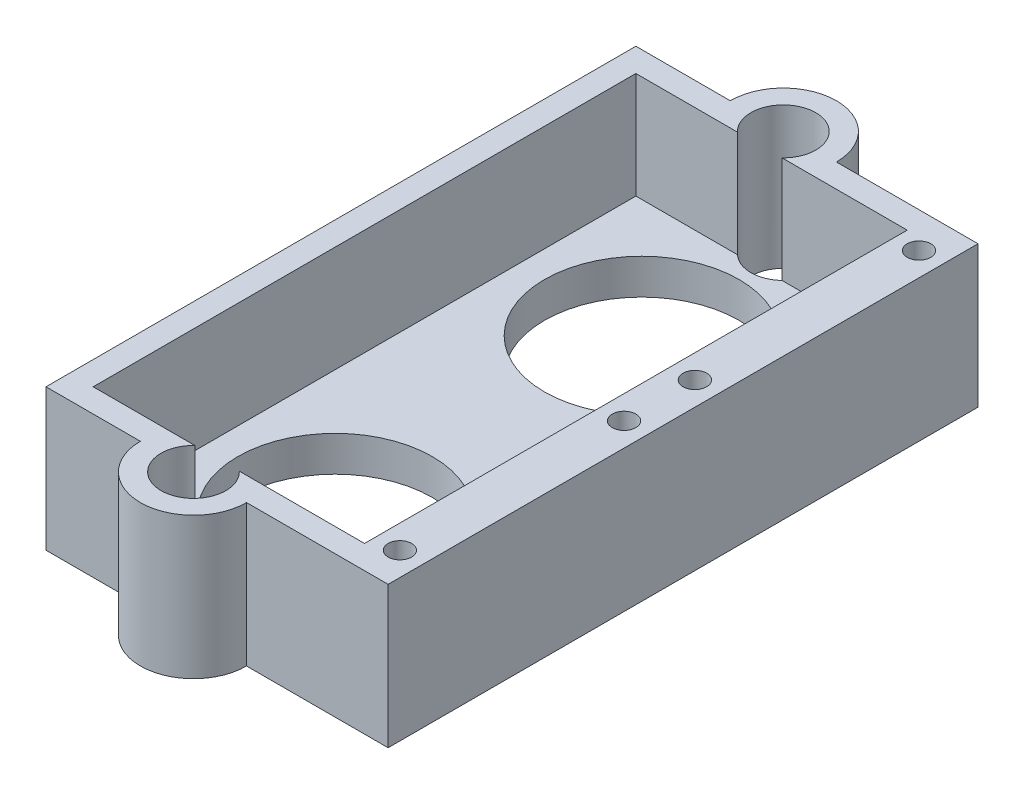
ISO-10303-21;
HEADER;
FILE_DESCRIPTION(('STEP AP214'),'2;1');
FILE_NAME('part.step','',(''),(''),'','','');
FILE_SCHEMA(('AUTOMOTIVE_DESIGN { 1 0 10303 214 1 1 1 1 }'));
ENDSEC;
DATA;
#1=APPLICATION_CONTEXT('core data for automotive mechanical design processes');
#2=APPLICATION_PROTOCOL_DEFINITION('international standard','automotive_design',2000,#1);
#3=PRODUCT_CONTEXT('',#1,'mechanical');
#4=PRODUCT('Part','Part','',(#3));
#5=PRODUCT_RELATED_PRODUCT_CATEGORY('part','',(#4));
#6=PRODUCT_DEFINITION_FORMATION('','',#4);
#7=PRODUCT_DEFINITION_CONTEXT('part definition',#1,'design');
#8=PRODUCT_DEFINITION('design','',#6,#7);
#9=PRODUCT_DEFINITION_SHAPE('','',#8);
#10=(LENGTH_UNIT() NAMED_UNIT(*) SI_UNIT(.MILLI.,.METRE.));
#11=(NAMED_UNIT(*) PLANE_ANGLE_UNIT() SI_UNIT($,.RADIAN.));
#12=(NAMED_UNIT(*) SI_UNIT($,.STERADIAN.) SOLID_ANGLE_UNIT());
#13=UNCERTAINTY_MEASURE_WITH_UNIT(LENGTH_MEASURE(1.E-05),#10,'distance_accuracy_value','');
#14=(GEOMETRIC_REPRESENTATION_CONTEXT(3) GLOBAL_UNCERTAINTY_ASSIGNED_CONTEXT((#13)) GLOBAL_UNIT_ASSIGNED_CONTEXT((#10,
#11,#12)) REPRESENTATION_CONTEXT('',''));
#15=CARTESIAN_POINT('',(0.,0.,0.));
#16=DIRECTION('',(0.,0.,1.));
#17=DIRECTION('',(1.,0.,0.));
#18=AXIS2_PLACEMENT_3D('',#15,#16,#17);
#19=CARTESIAN_POINT('',(0.,-8.25,34.));
#20=DIRECTION('',(0.,0.,-1.));
#21=DIRECTION('',(-1.,0.,0.));
#22=AXIS2_PLACEMENT_3D('',#19,#20,#21);
#23=PLANE('',#22);
#24=DIRECTION('',(-1.,0.,0.));
#25=VECTOR('',#24,1.);
#26=CARTESIAN_POINT('',(0.,3.75,34.));
#27=LINE('',#26,#25);
#28=CARTESIAN_POINT('',(-34.25,3.75,34.));
#29=VERTEX_POINT('',#28);
#30=CARTESIAN_POINT('',(-46.25,3.75,34.));
#31=VERTEX_POINT('',#30);
#32=EDGE_CURVE('E173',#29,#31,#27,.T.);
#33=ORIENTED_EDGE('',*,*,#32,.T.);
#34=DIRECTION('',(0.,-1.,0.));
#35=VECTOR('',#34,1.);
#36=CARTESIAN_POINT('',(-46.25,14.0953004301386,34.));
#37=LINE('',#36,#35);
#38=CARTESIAN_POINT('',(-46.25,-8.25,34.));
#39=VERTEX_POINT('',#38);
#40=EDGE_CURVE('E313',#31,#39,#37,.T.);
#41=ORIENTED_EDGE('',*,*,#40,.T.);
#42=DIRECTION('',(-1.,0.,0.));
#43=VECTOR('',#42,1.);
#44=CARTESIAN_POINT('',(0.,-8.25,34.));
#45=LINE('',#44,#43);
#46=CARTESIAN_POINT('',(-34.25,-8.25,34.));
#47=VERTEX_POINT('',#46);
#48=EDGE_CURVE('E206',#47,#39,#45,.T.);
#49=ORIENTED_EDGE('',*,*,#48,.F.);
#50=DIRECTION('',(0.,-1.,0.));
#51=VECTOR('',#50,1.);
#52=CARTESIAN_POINT('',(-34.25,53.9097448159378,34.));
#53=LINE('',#52,#51);
#54=EDGE_CURVE('E276',#29,#47,#53,.T.);
#55=ORIENTED_EDGE('',*,*,#54,.F.);
#56=EDGE_LOOP('',(#33,#41,#49,#55));
#57=FACE_BOUND('',#56,.T.);
#58=ADVANCED_FACE('F35',(#57),#23,.F.);
#59=CARTESIAN_POINT('',(0.,3.75,32.));
#60=DIRECTION('',(0.,0.,1.));
#61=DIRECTION('',(1.,0.,0.));
#62=AXIS2_PLACEMENT_3D('',#59,#60,#61);
#63=PLANE('',#62);
#64=DIRECTION('',(-1.,0.,0.));
#65=VECTOR('',#64,1.);
#66=CARTESIAN_POINT('',(0.,3.75,32.));
#67=LINE('',#66,#65);
#68=CARTESIAN_POINT('',(-52.6374586088177,3.75,32.));
#69=VERTEX_POINT('',#68);
#70=CARTESIAN_POINT('',(-61.25,3.75,32.));
#71=VERTEX_POINT('',#70);
#72=EDGE_CURVE('E171',#69,#71,#67,.T.);
#73=ORIENTED_EDGE('',*,*,#72,.F.);
#74=DIRECTION('',(0.,1.,0.));
#75=VECTOR('',#74,1.);
#76=CARTESIAN_POINT('',(-52.6374586088177,-14.25,32.));
#77=LINE('',#76,#75);
#78=CARTESIAN_POINT('',(-52.6374586088177,-5.25,32.));
#79=VERTEX_POINT('',#78);
#80=EDGE_CURVE('E50',#69,#79,#77,.F.);
#81=ORIENTED_EDGE('',*,*,#80,.T.);
#82=DIRECTION('',(-1.,0.,0.));
#83=VECTOR('',#82,1.);
#84=CARTESIAN_POINT('',(0.,-5.25,32.));
#85=LINE('',#84,#83);
#86=CARTESIAN_POINT('',(-61.25,-5.25,32.));
#87=VERTEX_POINT('',#86);
#88=EDGE_CURVE('E238',#79,#87,#85,.T.);
#89=ORIENTED_EDGE('',*,*,#88,.T.);
#90=DIRECTION('',(0.,-1.,0.));
#91=VECTOR('',#90,1.);
#92=CARTESIAN_POINT('',(-61.25,3.75,32.));
#93=LINE('',#92,#91);
#94=EDGE_CURVE('E189',#71,#87,#93,.T.);
#95=ORIENTED_EDGE('',*,*,#94,.F.);
#96=EDGE_LOOP('',(#73,#81,#89,#95));
#97=FACE_BOUND('',#96,.T.);
#98=ADVANCED_FACE('F393',(#97),#63,.F.);
#99=CARTESIAN_POINT('',(0.,-8.25,-16.));
#100=DIRECTION('',(0.,0.,-1.));
#101=DIRECTION('',(-1.,0.,0.));
#102=AXIS2_PLACEMENT_3D('',#99,#100,#101);
#103=PLANE('',#102);
#104=DIRECTION('',(0.,-1.,0.));
#105=VECTOR('',#104,1.);
#106=CARTESIAN_POINT('',(-46.25,14.0953004301386,-16.));
#107=LINE('',#106,#105);
#108=CARTESIAN_POINT('',(-46.25,3.75,-16.));
#109=VERTEX_POINT('',#108);
#110=CARTESIAN_POINT('',(-46.25,-8.25,-16.));
#111=VERTEX_POINT('',#110);
#112=EDGE_CURVE('E271',#109,#111,#107,.T.);
#113=ORIENTED_EDGE('',*,*,#112,.F.);
#114=DIRECTION('',(1.,0.,0.));
#115=VECTOR('',#114,1.);
#116=CARTESIAN_POINT('',(0.,3.75,-16.));
#117=LINE('',#116,#115);
#118=CARTESIAN_POINT('',(-34.25,3.75,-16.));
#119=VERTEX_POINT('',#118);
#120=EDGE_CURVE('E182',#109,#119,#117,.T.);
#121=ORIENTED_EDGE('',*,*,#120,.T.);
#122=DIRECTION('',(0.,-1.,0.));
#123=VECTOR('',#122,1.);
#124=CARTESIAN_POINT('',(-34.25,53.9097448159378,-16.));
#125=LINE('',#124,#123);
#126=CARTESIAN_POINT('',(-34.25,-8.25,-16.));
#127=VERTEX_POINT('',#126);
#128=EDGE_CURVE('E287',#119,#127,#125,.T.);
#129=ORIENTED_EDGE('',*,*,#128,.T.);
#130=DIRECTION('',(-1.,0.,0.));
#131=VECTOR('',#130,1.);
#132=CARTESIAN_POINT('',(0.,-8.25,-16.));
#133=LINE('',#132,#131);
#134=EDGE_CURVE('E214',#127,#111,#133,.T.);
#135=ORIENTED_EDGE('',*,*,#134,.T.);
#136=EDGE_LOOP('',(#113,#121,#129,#135));
#137=FACE_BOUND('',#136,.T.);
#138=ADVANCED_FACE('F295',(#137),#103,.T.);
#139=CARTESIAN_POINT('',(0.,3.75,-14.));
#140=DIRECTION('',(0.,0.,1.));
#141=DIRECTION('',(1.,0.,0.));
#142=AXIS2_PLACEMENT_3D('',#139,#140,#141);
#143=PLANE('',#142);
#144=DIRECTION('',(0.,1.,0.));
#145=VECTOR('',#144,1.);
#146=CARTESIAN_POINT('',(-52.6374586088177,-14.25,-14.));
#147=LINE('',#146,#145);
#148=CARTESIAN_POINT('',(-52.6374586088177,3.75,-14.));
#149=VERTEX_POINT('',#148);
#150=CARTESIAN_POINT('',(-52.6374586088177,-5.25,-14.));
#151=VERTEX_POINT('',#150);
#152=EDGE_CURVE('E256',#149,#151,#147,.F.);
#153=ORIENTED_EDGE('',*,*,#152,.F.);
#154=DIRECTION('',(-1.,0.,0.));
#155=VECTOR('',#154,1.);
#156=CARTESIAN_POINT('',(0.,3.75,-14.));
#157=LINE('',#156,#155);
#158=CARTESIAN_POINT('',(-61.25,3.75,-14.));
#159=VERTEX_POINT('',#158);
#160=EDGE_CURVE('E185',#149,#159,#157,.T.);
#161=ORIENTED_EDGE('',*,*,#160,.T.);
#162=DIRECTION('',(0.,-1.,0.));
#163=VECTOR('',#162,1.);
#164=CARTESIAN_POINT('',(-61.25,3.75,-14.));
#165=LINE('',#164,#163);
#166=CARTESIAN_POINT('',(-61.25,-5.25,-14.));
#167=VERTEX_POINT('',#166);
#168=EDGE_CURVE('E190',#159,#167,#165,.T.);
#169=ORIENTED_EDGE('',*,*,#168,.T.);
#170=DIRECTION('',(-1.,0.,0.));
#171=VECTOR('',#170,1.);
#172=CARTESIAN_POINT('',(0.,-5.25,-14.));
#173=LINE('',#172,#171);
#174=EDGE_CURVE('E43',#151,#167,#173,.T.);
#175=ORIENTED_EDGE('',*,*,#174,.F.);
#176=EDGE_LOOP('',(#153,#161,#169,#175));
#177=FACE_BOUND('',#176,.T.);
#178=ADVANCED_FACE('F255',(#177),#143,.T.);
#179=CARTESIAN_POINT('',(-40.25,-0.25,5.99999999999999));
#180=DIRECTION('',(0.,-1.,0.));
#181=DIRECTION('',(0.,0.,-1.));
#182=AXIS2_PLACEMENT_3D('',#179,#180,#181);
#183=CYLINDRICAL_SURFACE('',#182,0.999999999999998);
#184=CARTESIAN_POINT('',(-40.25,-8.25,5.99999999999999));
#185=DIRECTION('',(0.,-1.,0.));
#186=DIRECTION('',(0.,0.,-1.));
#187=AXIS2_PLACEMENT_3D('',#184,#185,#186);
#188=CIRCLE('',#187,0.999999999999998);
#189=CARTESIAN_POINT('',(-40.25,-8.25,5.));
#190=VERTEX_POINT('',#189);
#191=EDGE_CURVE('E233',#190,#190,#188,.T.);
#192=ORIENTED_EDGE('',*,*,#191,.T.);
#193=EDGE_LOOP('',(#192));
#194=FACE_BOUND('',#193,.T.);
#195=CARTESIAN_POINT('',(-40.25,-5.25,5.99999999999999));
#196=DIRECTION('',(0.,1.,0.));
#197=DIRECTION('',(0.,0.,1.));
#198=AXIS2_PLACEMENT_3D('',#195,#196,#197);
#199=CIRCLE('',#198,0.999999999999998);
#200=CARTESIAN_POINT('',(-40.25,-5.25,6.99999999999999));
#201=VERTEX_POINT('',#200);
#202=EDGE_CURVE('E202',#201,#201,#199,.F.);
#203=ORIENTED_EDGE('',*,*,#202,.F.);
#204=EDGE_LOOP('',(#203));
#205=FACE_BOUND('',#204,.T.);
#206=ADVANCED_FACE('F37',(#194,#205),#183,.F.);
#207=CARTESIAN_POINT('',(-40.25,-0.25,12.));
#208=DIRECTION('',(0.,-1.,0.));
#209=DIRECTION('',(0.,0.,-1.));
#210=AXIS2_PLACEMENT_3D('',#207,#208,#209);
#211=CYLINDRICAL_SURFACE('',#210,0.999999999999998);
#212=CARTESIAN_POINT('',(-40.25,-8.25,12.));
#213=DIRECTION('',(0.,-1.,0.));
#214=DIRECTION('',(0.,0.,-1.));
#215=AXIS2_PLACEMENT_3D('',#212,#213,#214);
#216=CIRCLE('',#215,0.999999999999998);
#217=CARTESIAN_POINT('',(-40.25,-8.25,11.));
#218=VERTEX_POINT('',#217);
#219=EDGE_CURVE('E232',#218,#218,#216,.T.);
#220=ORIENTED_EDGE('',*,*,#219,.T.);
#221=EDGE_LOOP('',(#220));
#222=FACE_BOUND('',#221,.T.);
#223=CARTESIAN_POINT('',(-40.25,-5.25,12.));
#224=DIRECTION('',(0.,1.,0.));
#225=DIRECTION('',(0.,0.,1.));
#226=AXIS2_PLACEMENT_3D('',#223,#224,#225);
#227=CIRCLE('',#226,0.999999999999998);
#228=CARTESIAN_POINT('',(-40.25,-5.25,13.));
#229=VERTEX_POINT('',#228);
#230=EDGE_CURVE('E193',#229,#229,#227,.F.);
#231=ORIENTED_EDGE('',*,*,#230,.F.);
#232=EDGE_LOOP('',(#231));
#233=FACE_BOUND('',#232,.T.);
#234=ADVANCED_FACE('F412',(#222,#233),#211,.F.);
#235=CARTESIAN_POINT('',(0.,-8.25,0.));
#236=DIRECTION('',(0.,-1.,0.));
#237=DIRECTION('',(0.,0.,-1.));
#238=AXIS2_PLACEMENT_3D('',#235,#236,#237);
#239=PLANE('',#238);
#240=CARTESIAN_POINT('',(-50.75,-8.25,34.));
#241=DIRECTION('',(0.,-1.,0.));
#242=DIRECTION('',(0.,0.,-1.));
#243=AXIS2_PLACEMENT_3D('',#240,#241,#242);
#244=CIRCLE('',#243,2.75);
#245=CARTESIAN_POINT('',(-50.75,-8.25,31.25));
#246=VERTEX_POINT('',#245);
#247=EDGE_CURVE('E347',#246,#246,#244,.T.);
#248=ORIENTED_EDGE('',*,*,#247,.F.);
#249=EDGE_LOOP('',(#248));
#250=FACE_BOUND('',#249,.T.);
#251=CARTESIAN_POINT('',(-50.75,-8.25,-16.));
#252=DIRECTION('',(0.,-1.,0.));
#253=DIRECTION('',(0.,0.,-1.));
#254=AXIS2_PLACEMENT_3D('',#251,#252,#253);
#255=CIRCLE('',#254,2.75);
#256=CARTESIAN_POINT('',(-50.75,-8.25,-18.75));
#257=VERTEX_POINT('',#256);
#258=EDGE_CURVE('E337',#257,#257,#255,.T.);
#259=ORIENTED_EDGE('',*,*,#258,.F.);
#260=EDGE_LOOP('',(#259));
#261=FACE_BOUND('',#260,.T.);
#262=ORIENTED_EDGE('',*,*,#48,.T.);
#263=CARTESIAN_POINT('',(-50.75,-8.25,34.));
#264=DIRECTION('',(0.,-1.,0.));
#265=DIRECTION('',(0.,0.,-1.));
#266=AXIS2_PLACEMENT_3D('',#263,#264,#265);
#267=CIRCLE('',#266,4.50000000000001);
#268=CARTESIAN_POINT('',(-55.25,-8.25,34.));
#269=VERTEX_POINT('',#268);
#270=EDGE_CURVE('E333',#39,#269,#267,.T.);
#271=ORIENTED_EDGE('',*,*,#270,.T.);
#272=CARTESIAN_POINT('',(-63.25,-8.25,34.));
#273=VERTEX_POINT('',#272);
#274=EDGE_CURVE('E210',#269,#273,#45,.T.);
#275=ORIENTED_EDGE('',*,*,#274,.T.);
#276=DIRECTION('',(0.,0.,-1.));
#277=VECTOR('',#276,1.);
#278=CARTESIAN_POINT('',(-63.25,-8.25,0.));
#279=LINE('',#278,#277);
#280=CARTESIAN_POINT('',(-63.25,-8.25,-16.));
#281=VERTEX_POINT('',#280);
#282=EDGE_CURVE('E209',#273,#281,#279,.T.);
#283=ORIENTED_EDGE('',*,*,#282,.T.);
#284=CARTESIAN_POINT('',(-55.25,-8.25,-16.));
#285=VERTEX_POINT('',#284);
#286=EDGE_CURVE('E213',#285,#281,#133,.T.);
#287=ORIENTED_EDGE('',*,*,#286,.F.);
#288=CARTESIAN_POINT('',(-50.75,-8.25,-16.));
#289=DIRECTION('',(0.,-1.,0.));
#290=DIRECTION('',(0.,0.,-1.));
#291=AXIS2_PLACEMENT_3D('',#288,#289,#290);
#292=CIRCLE('',#291,4.5);
#293=EDGE_CURVE('E309',#285,#111,#292,.T.);
#294=ORIENTED_EDGE('',*,*,#293,.T.);
#295=ORIENTED_EDGE('',*,*,#134,.F.);
#296=DIRECTION('',(0.,0.,1.));
#297=VECTOR('',#296,1.);
#298=CARTESIAN_POINT('',(-34.25,-8.25,-16.));
#299=LINE('',#298,#297);
#300=EDGE_CURVE('E284',#127,#47,#299,.T.);
#301=ORIENTED_EDGE('',*,*,#300,.T.);
#302=EDGE_LOOP('',(#262,#271,#275,#283,#287,#294,#295,#301));
#303=FACE_BOUND('',#302,.T.);
#304=ORIENTED_EDGE('',*,*,#219,.F.);
#305=EDGE_LOOP('',(#304));
#306=FACE_BOUND('',#305,.T.);
#307=ORIENTED_EDGE('',*,*,#191,.F.);
#308=EDGE_LOOP('',(#307));
#309=FACE_BOUND('',#308,.T.);
#310=CARTESIAN_POINT('',(-50.75,-8.25,-4.00000000000001));
#311=DIRECTION('',(0.,-1.,0.));
#312=DIRECTION('',(0.,0.,-1.));
#313=AXIS2_PLACEMENT_3D('',#310,#311,#312);
#314=CIRCLE('',#313,8.25);
#315=CARTESIAN_POINT('',(-50.75,-8.25,-12.25));
#316=VERTEX_POINT('',#315);
#317=EDGE_CURVE('E216',#316,#316,#314,.T.);
#318=ORIENTED_EDGE('',*,*,#317,.F.);
#319=EDGE_LOOP('',(#318));
#320=FACE_BOUND('',#319,.T.);
#321=CARTESIAN_POINT('',(-50.75,-8.25,22.));
#322=DIRECTION('',(0.,-1.,0.));
#323=DIRECTION('',(0.,0.,-1.));
#324=AXIS2_PLACEMENT_3D('',#321,#322,#323);
#325=CIRCLE('',#324,8.25);
#326=CARTESIAN_POINT('',(-50.75,-8.25,13.75));
#327=VERTEX_POINT('',#326);
#328=EDGE_CURVE('E219',#327,#327,#325,.F.);
#329=ORIENTED_EDGE('',*,*,#328,.T.);
#330=EDGE_LOOP('',(#329));
#331=FACE_BOUND('',#330,.T.);
#332=CARTESIAN_POINT('',(-36.25,-8.25,12.));
#333=DIRECTION('',(0.,-1.,0.));
#334=DIRECTION('',(0.,0.,-1.));
#335=AXIS2_PLACEMENT_3D('',#332,#333,#334);
#336=CIRCLE('',#335,0.999999999999998);
#337=CARTESIAN_POINT('',(-36.25,-8.25,11.));
#338=VERTEX_POINT('',#337);
#339=EDGE_CURVE('E278',#338,#338,#336,.T.);
#340=ORIENTED_EDGE('',*,*,#339,.F.);
#341=EDGE_LOOP('',(#340));
#342=FACE_BOUND('',#341,.T.);
#343=CARTESIAN_POINT('',(-36.25,-8.25,5.99999999999999));
#344=DIRECTION('',(0.,-1.,0.));
#345=DIRECTION('',(0.,0.,-1.));
#346=AXIS2_PLACEMENT_3D('',#343,#344,#345);
#347=CIRCLE('',#346,0.999999999999998);
#348=CARTESIAN_POINT('',(-36.25,-8.25,5.));
#349=VERTEX_POINT('',#348);
#350=EDGE_CURVE('E281',#349,#349,#347,.T.);
#351=ORIENTED_EDGE('',*,*,#350,.F.);
#352=EDGE_LOOP('',(#351));
#353=FACE_BOUND('',#352,.T.);
#354=ADVANCED_FACE('F302',(#250,#261,#303,#306,#309,#320,#331,#342,#353),#239,.T.);
#355=ORIENTED_EDGE('',*,*,#274,.F.);
#356=DIRECTION('',(0.,-1.,0.));
#357=VECTOR('',#356,1.);
#358=CARTESIAN_POINT('',(-55.25,14.0953004301386,34.));
#359=LINE('',#358,#357);
#360=CARTESIAN_POINT('',(-55.25,3.75,34.));
#361=VERTEX_POINT('',#360);
#362=EDGE_CURVE('E318',#269,#361,#359,.F.);
#363=ORIENTED_EDGE('',*,*,#362,.T.);
#364=CARTESIAN_POINT('',(-63.25,3.75,34.));
#365=VERTEX_POINT('',#364);
#366=EDGE_CURVE('E170',#361,#365,#27,.T.);
#367=ORIENTED_EDGE('',*,*,#366,.T.);
#368=DIRECTION('',(0.,1.,0.));
#369=VECTOR('',#368,1.);
#370=CARTESIAN_POINT('',(-63.25,-8.25,34.));
#371=LINE('',#370,#369);
#372=EDGE_CURVE('E229',#273,#365,#371,.T.);
#373=ORIENTED_EDGE('',*,*,#372,.F.);
#374=EDGE_LOOP('',(#355,#363,#367,#373));
#375=FACE_BOUND('',#374,.T.);
#376=ADVANCED_FACE('F395',(#375),#23,.F.);
#377=CARTESIAN_POINT('',(-63.25,-8.25,0.));
#378=DIRECTION('',(1.,0.,0.));
#379=DIRECTION('',(0.,0.,-1.));
#380=AXIS2_PLACEMENT_3D('',#377,#378,#379);
#381=PLANE('',#380);
#382=ORIENTED_EDGE('',*,*,#372,.T.);
#383=DIRECTION('',(0.,0.,-1.));
#384=VECTOR('',#383,1.);
#385=CARTESIAN_POINT('',(-63.25,3.75,0.));
#386=LINE('',#385,#384);
#387=CARTESIAN_POINT('',(-63.25,3.75,-16.));
#388=VERTEX_POINT('',#387);
#389=EDGE_CURVE('E179',#365,#388,#386,.T.);
#390=ORIENTED_EDGE('',*,*,#389,.T.);
#391=DIRECTION('',(0.,1.,0.));
#392=VECTOR('',#391,1.);
#393=CARTESIAN_POINT('',(-63.25,-8.25,-16.));
#394=LINE('',#393,#392);
#395=EDGE_CURVE('E222',#281,#388,#394,.T.);
#396=ORIENTED_EDGE('',*,*,#395,.F.);
#397=ORIENTED_EDGE('',*,*,#282,.F.);
#398=EDGE_LOOP('',(#382,#390,#396,#397));
#399=FACE_BOUND('',#398,.T.);
#400=ADVANCED_FACE('F404',(#399),#381,.F.);
#401=DIRECTION('',(0.,-1.,0.));
#402=VECTOR('',#401,1.);
#403=CARTESIAN_POINT('',(-55.25,14.0953004301386,-16.));
#404=LINE('',#403,#402);
#405=CARTESIAN_POINT('',(-55.25,3.75,-16.));
#406=VERTEX_POINT('',#405);
#407=EDGE_CURVE('E316',#285,#406,#404,.F.);
#408=ORIENTED_EDGE('',*,*,#407,.F.);
#409=ORIENTED_EDGE('',*,*,#286,.T.);
#410=ORIENTED_EDGE('',*,*,#395,.T.);
#411=EDGE_CURVE('E183',#388,#406,#117,.T.);
#412=ORIENTED_EDGE('',*,*,#411,.T.);
#413=EDGE_LOOP('',(#408,#409,#410,#412));
#414=FACE_BOUND('',#413,.T.);
#415=ADVANCED_FACE('F410',(#414),#103,.T.);
#416=CARTESIAN_POINT('',(-50.75,-8.25,-4.00000000000001));
#417=DIRECTION('',(0.,1.,0.));
#418=DIRECTION('',(0.,0.,1.));
#419=AXIS2_PLACEMENT_3D('',#416,#417,#418);
#420=CYLINDRICAL_SURFACE('',#419,8.25);
#421=ORIENTED_EDGE('',*,*,#317,.T.);
#422=EDGE_LOOP('',(#421));
#423=FACE_BOUND('',#422,.T.);
#424=CARTESIAN_POINT('',(-50.75,-5.25,-4.00000000000001));
#425=DIRECTION('',(0.,-1.,0.));
#426=DIRECTION('',(0.,0.,-1.));
#427=AXIS2_PLACEMENT_3D('',#424,#425,#426);
#428=CIRCLE('',#427,8.25);
#429=CARTESIAN_POINT('',(-50.75,-5.25,-12.25));
#430=VERTEX_POINT('',#429);
#431=EDGE_CURVE('E205',#430,#430,#428,.T.);
#432=ORIENTED_EDGE('',*,*,#431,.F.);
#433=EDGE_LOOP('',(#432));
#434=FACE_BOUND('',#433,.T.);
#435=ADVANCED_FACE('F419',(#423,#434),#420,.F.);
#436=CARTESIAN_POINT('',(-50.75,-8.25,22.));
#437=DIRECTION('',(0.,1.,0.));
#438=DIRECTION('',(0.,0.,1.));
#439=AXIS2_PLACEMENT_3D('',#436,#437,#438);
#440=CYLINDRICAL_SURFACE('',#439,8.25);
#441=ORIENTED_EDGE('',*,*,#328,.F.);
#442=EDGE_LOOP('',(#441));
#443=FACE_BOUND('',#442,.T.);
#444=CARTESIAN_POINT('',(-50.75,-5.25,22.));
#445=DIRECTION('',(0.,-1.,0.));
#446=DIRECTION('',(0.,0.,-1.));
#447=AXIS2_PLACEMENT_3D('',#444,#445,#446);
#448=CIRCLE('',#447,8.25);
#449=CARTESIAN_POINT('',(-50.75,-5.25,13.75));
#450=VERTEX_POINT('',#449);
#451=EDGE_CURVE('E225',#450,#450,#448,.F.);
#452=ORIENTED_EDGE('',*,*,#451,.T.);
#453=EDGE_LOOP('',(#452));
#454=FACE_BOUND('',#453,.T.);
#455=ADVANCED_FACE('F424',(#443,#454),#440,.F.);
#456=CARTESIAN_POINT('',(0.,-5.25,0.));
#457=DIRECTION('',(0.,-1.,0.));
#458=DIRECTION('',(0.,0.,-1.));
#459=AXIS2_PLACEMENT_3D('',#456,#457,#458);
#460=PLANE('',#459);
#461=ORIENTED_EDGE('',*,*,#88,.F.);
#462=CARTESIAN_POINT('',(-50.75,-5.25,34.));
#463=DIRECTION('',(0.,-1.,0.));
#464=DIRECTION('',(0.,0.,-1.));
#465=AXIS2_PLACEMENT_3D('',#462,#463,#464);
#466=CIRCLE('',#465,2.75);
#467=CARTESIAN_POINT('',(-48.8625413911823,-5.25,32.));
#468=VERTEX_POINT('',#467);
#469=EDGE_CURVE('E163',#79,#468,#466,.T.);
#470=ORIENTED_EDGE('',*,*,#469,.T.);
#471=CARTESIAN_POINT('',(-38.25,-5.25,32.));
#472=VERTEX_POINT('',#471);
#473=EDGE_CURVE('E162',#472,#468,#85,.T.);
#474=ORIENTED_EDGE('',*,*,#473,.F.);
#475=DIRECTION('',(0.,0.,1.));
#476=VECTOR('',#475,1.);
#477=CARTESIAN_POINT('',(-38.25,-5.25,3.99999999999999));
#478=LINE('',#477,#476);
#479=CARTESIAN_POINT('',(-38.25,-5.25,-14.));
#480=VERTEX_POINT('',#479);
#481=EDGE_CURVE('E236',#480,#472,#478,.T.);
#482=ORIENTED_EDGE('',*,*,#481,.F.);
#483=CARTESIAN_POINT('',(-48.8625413911823,-5.25,-14.));
#484=VERTEX_POINT('',#483);
#485=EDGE_CURVE('E11',#480,#484,#173,.T.);
#486=ORIENTED_EDGE('',*,*,#485,.T.);
#487=CARTESIAN_POINT('',(-50.75,-5.25,-16.));
#488=DIRECTION('',(0.,-1.,0.));
#489=DIRECTION('',(0.,0.,-1.));
#490=AXIS2_PLACEMENT_3D('',#487,#488,#489);
#491=CIRCLE('',#490,2.75);
#492=EDGE_CURVE('E252',#484,#151,#491,.T.);
#493=ORIENTED_EDGE('',*,*,#492,.T.);
#494=ORIENTED_EDGE('',*,*,#174,.T.);
#495=DIRECTION('',(0.,0.,-1.));
#496=VECTOR('',#495,1.);
#497=CARTESIAN_POINT('',(-61.25,-5.25,0.));
#498=LINE('',#497,#496);
#499=EDGE_CURVE('E241',#87,#167,#498,.T.);
#500=ORIENTED_EDGE('',*,*,#499,.F.);
#501=EDGE_LOOP('',(#461,#470,#474,#482,#486,#493,#494,#500));
#502=FACE_BOUND('',#501,.T.);
#503=ORIENTED_EDGE('',*,*,#431,.T.);
#504=EDGE_LOOP('',(#503));
#505=FACE_BOUND('',#504,.T.);
#506=ORIENTED_EDGE('',*,*,#451,.F.);
#507=EDGE_LOOP('',(#506));
#508=FACE_BOUND('',#507,.T.);
#509=ORIENTED_EDGE('',*,*,#230,.T.);
#510=EDGE_LOOP('',(#509));
#511=FACE_BOUND('',#510,.T.);
#512=ORIENTED_EDGE('',*,*,#202,.T.);
#513=EDGE_LOOP('',(#512));
#514=FACE_BOUND('',#513,.T.);
#515=ADVANCED_FACE('F250',(#502,#505,#508,#511,#514),#460,.F.);
#516=CARTESIAN_POINT('',(-61.25,3.75,0.));
#517=DIRECTION('',(-1.,0.,0.));
#518=DIRECTION('',(0.,0.,1.));
#519=AXIS2_PLACEMENT_3D('',#516,#517,#518);
#520=PLANE('',#519);
#521=ORIENTED_EDGE('',*,*,#94,.T.);
#522=ORIENTED_EDGE('',*,*,#499,.T.);
#523=ORIENTED_EDGE('',*,*,#168,.F.);
#524=DIRECTION('',(0.,0.,-1.));
#525=VECTOR('',#524,1.);
#526=CARTESIAN_POINT('',(-61.25,3.75,0.));
#527=LINE('',#526,#525);
#528=EDGE_CURVE('E175',#71,#159,#527,.T.);
#529=ORIENTED_EDGE('',*,*,#528,.F.);
#530=EDGE_LOOP('',(#521,#522,#523,#529));
#531=FACE_BOUND('',#530,.T.);
#532=ADVANCED_FACE('F260',(#531),#520,.F.);
#533=DIRECTION('',(0.,1.,0.));
#534=VECTOR('',#533,1.);
#535=CARTESIAN_POINT('',(-48.8625413911823,-14.25,-14.));
#536=LINE('',#535,#534);
#537=CARTESIAN_POINT('',(-48.8625413911823,3.75,-14.));
#538=VERTEX_POINT('',#537);
#539=EDGE_CURVE('E58',#484,#538,#536,.T.);
#540=ORIENTED_EDGE('',*,*,#539,.F.);
#541=ORIENTED_EDGE('',*,*,#485,.F.);
#542=DIRECTION('',(0.,-1.,0.));
#543=VECTOR('',#542,1.);
#544=CARTESIAN_POINT('',(-38.25,3.75,-14.));
#545=LINE('',#544,#543);
#546=CARTESIAN_POINT('',(-38.25,3.75,-14.));
#547=VERTEX_POINT('',#546);
#548=EDGE_CURVE('E194',#547,#480,#545,.T.);
#549=ORIENTED_EDGE('',*,*,#548,.F.);
#550=EDGE_CURVE('E186',#547,#538,#157,.T.);
#551=ORIENTED_EDGE('',*,*,#550,.T.);
#552=EDGE_LOOP('',(#540,#541,#549,#551));
#553=FACE_BOUND('',#552,.T.);
#554=ADVANCED_FACE('F432',(#553),#143,.T.);
#555=ORIENTED_EDGE('',*,*,#473,.T.);
#556=DIRECTION('',(0.,1.,0.));
#557=VECTOR('',#556,1.);
#558=CARTESIAN_POINT('',(-48.8625413911823,-14.25,32.));
#559=LINE('',#558,#557);
#560=CARTESIAN_POINT('',(-48.8625413911823,3.75,32.));
#561=VERTEX_POINT('',#560);
#562=EDGE_CURVE('E148',#468,#561,#559,.T.);
#563=ORIENTED_EDGE('',*,*,#562,.T.);
#564=CARTESIAN_POINT('',(-38.25,3.75,32.));
#565=VERTEX_POINT('',#564);
#566=EDGE_CURVE('E160',#565,#561,#67,.T.);
#567=ORIENTED_EDGE('',*,*,#566,.F.);
#568=DIRECTION('',(0.,-1.,0.));
#569=VECTOR('',#568,1.);
#570=CARTESIAN_POINT('',(-38.25,3.75,32.));
#571=LINE('',#570,#569);
#572=EDGE_CURVE('E196',#565,#472,#571,.T.);
#573=ORIENTED_EDGE('',*,*,#572,.T.);
#574=EDGE_LOOP('',(#555,#563,#567,#573));
#575=FACE_BOUND('',#574,.T.);
#576=ADVANCED_FACE('F158',(#575),#63,.F.);
#577=CARTESIAN_POINT('',(0.,3.75,0.));
#578=DIRECTION('',(0.,-1.,0.));
#579=DIRECTION('',(0.,0.,-1.));
#580=AXIS2_PLACEMENT_3D('',#577,#578,#579);
#581=PLANE('',#580);
#582=CARTESIAN_POINT('',(-36.25,3.75,-13.));
#583=DIRECTION('',(0.,1.,0.));
#584=DIRECTION('',(0.,0.,1.));
#585=AXIS2_PLACEMENT_3D('',#582,#583,#584);
#586=CIRCLE('',#585,0.999999999999998);
#587=CARTESIAN_POINT('',(-36.25,3.75,-12.));
#588=VERTEX_POINT('',#587);
#589=EDGE_CURVE('E358',#588,#588,#586,.T.);
#590=ORIENTED_EDGE('',*,*,#589,.F.);
#591=EDGE_LOOP('',(#590));
#592=FACE_BOUND('',#591,.T.);
#593=CARTESIAN_POINT('',(-36.25,3.75,31.));
#594=DIRECTION('',(0.,1.,0.));
#595=DIRECTION('',(0.,0.,1.));
#596=AXIS2_PLACEMENT_3D('',#593,#594,#595);
#597=CIRCLE('',#596,0.999999999999998);
#598=CARTESIAN_POINT('',(-36.25,3.75,32.));
#599=VERTEX_POINT('',#598);
#600=EDGE_CURVE('E352',#599,#599,#597,.T.);
#601=ORIENTED_EDGE('',*,*,#600,.F.);
#602=EDGE_LOOP('',(#601));
#603=FACE_BOUND('',#602,.T.);
#604=ORIENTED_EDGE('',*,*,#566,.T.);
#605=CARTESIAN_POINT('',(-50.75,3.75,34.));
#606=DIRECTION('',(0.,1.,0.));
#607=DIRECTION('',(0.,0.,1.));
#608=AXIS2_PLACEMENT_3D('',#605,#606,#607);
#609=CIRCLE('',#608,2.75);
#610=EDGE_CURVE('E145',#69,#561,#609,.T.);
#611=ORIENTED_EDGE('',*,*,#610,.F.);
#612=ORIENTED_EDGE('',*,*,#72,.T.);
#613=ORIENTED_EDGE('',*,*,#528,.T.);
#614=ORIENTED_EDGE('',*,*,#160,.F.);
#615=CARTESIAN_POINT('',(-50.75,3.75,-16.));
#616=DIRECTION('',(0.,1.,0.));
#617=DIRECTION('',(0.,0.,1.));
#618=AXIS2_PLACEMENT_3D('',#615,#616,#617);
#619=CIRCLE('',#618,2.75);
#620=EDGE_CURVE('E345',#538,#149,#619,.T.);
#621=ORIENTED_EDGE('',*,*,#620,.F.);
#622=ORIENTED_EDGE('',*,*,#550,.F.);
#623=DIRECTION('',(0.,0.,1.));
#624=VECTOR('',#623,1.);
#625=CARTESIAN_POINT('',(-38.25,3.75,-16.));
#626=LINE('',#625,#624);
#627=EDGE_CURVE('E169',#547,#565,#626,.T.);
#628=ORIENTED_EDGE('',*,*,#627,.T.);
#629=EDGE_LOOP('',(#604,#611,#612,#613,#614,#621,#622,#628));
#630=FACE_BOUND('',#629,.T.);
#631=CARTESIAN_POINT('',(-50.75,3.75,34.));
#632=DIRECTION('',(0.,-1.,0.));
#633=DIRECTION('',(0.,0.,-1.));
#634=AXIS2_PLACEMENT_3D('',#631,#632,#633);
#635=CIRCLE('',#634,4.50000000000001);
#636=EDGE_CURVE('E332',#361,#31,#635,.F.);
#637=ORIENTED_EDGE('',*,*,#636,.T.);
#638=ORIENTED_EDGE('',*,*,#32,.F.);
#639=DIRECTION('',(0.,0.,-1.));
#640=VECTOR('',#639,1.);
#641=CARTESIAN_POINT('',(-34.25,3.75,-16.));
#642=LINE('',#641,#640);
#643=EDGE_CURVE('E273',#29,#119,#642,.T.);
#644=ORIENTED_EDGE('',*,*,#643,.T.);
#645=ORIENTED_EDGE('',*,*,#120,.F.);
#646=CARTESIAN_POINT('',(-50.75,3.75,-16.));
#647=DIRECTION('',(0.,-1.,0.));
#648=DIRECTION('',(0.,0.,-1.));
#649=AXIS2_PLACEMENT_3D('',#646,#647,#648);
#650=CIRCLE('',#649,4.5);
#651=EDGE_CURVE('E312',#109,#406,#650,.F.);
#652=ORIENTED_EDGE('',*,*,#651,.T.);
#653=ORIENTED_EDGE('',*,*,#411,.F.);
#654=ORIENTED_EDGE('',*,*,#389,.F.);
#655=ORIENTED_EDGE('',*,*,#366,.F.);
#656=EDGE_LOOP('',(#637,#638,#644,#645,#652,#653,#654,#655));
#657=FACE_BOUND('',#656,.T.);
#658=CARTESIAN_POINT('',(-36.25,3.75,5.99999999999999));
#659=DIRECTION('',(0.,-1.,0.));
#660=DIRECTION('',(0.,0.,-1.));
#661=AXIS2_PLACEMENT_3D('',#658,#659,#660);
#662=CIRCLE('',#661,0.999999999999998);
#663=CARTESIAN_POINT('',(-36.25,3.75,5.));
#664=VERTEX_POINT('',#663);
#665=EDGE_CURVE('E262',#664,#664,#662,.F.);
#666=ORIENTED_EDGE('',*,*,#665,.F.);
#667=EDGE_LOOP('',(#666));
#668=FACE_BOUND('',#667,.T.);
#669=CARTESIAN_POINT('',(-36.25,3.75,12.));
#670=DIRECTION('',(0.,-1.,0.));
#671=DIRECTION('',(0.,0.,-1.));
#672=AXIS2_PLACEMENT_3D('',#669,#670,#671);
#673=CIRCLE('',#672,0.999999999999998);
#674=CARTESIAN_POINT('',(-36.25,3.75,11.));
#675=VERTEX_POINT('',#674);
#676=EDGE_CURVE('E264',#675,#675,#673,.F.);
#677=ORIENTED_EDGE('',*,*,#676,.F.);
#678=EDGE_LOOP('',(#677));
#679=FACE_BOUND('',#678,.T.);
#680=ADVANCED_FACE('F166',(#592,#603,#630,#657,#668,#679),#581,.F.);
#681=CARTESIAN_POINT('',(-34.25,53.9097448159378,-16.));
#682=DIRECTION('',(1.,0.,0.));
#683=DIRECTION('',(0.,0.,-1.));
#684=AXIS2_PLACEMENT_3D('',#681,#682,#683);
#685=PLANE('',#684);
#686=ORIENTED_EDGE('',*,*,#643,.F.);
#687=ORIENTED_EDGE('',*,*,#54,.T.);
#688=ORIENTED_EDGE('',*,*,#300,.F.);
#689=ORIENTED_EDGE('',*,*,#128,.F.);
#690=EDGE_LOOP('',(#686,#687,#688,#689));
#691=FACE_BOUND('',#690,.T.);
#692=ADVANCED_FACE('F299',(#691),#685,.T.);
#693=CARTESIAN_POINT('',(-38.25,53.9097448159378,-16.));
#694=DIRECTION('',(-1.,0.,0.));
#695=DIRECTION('',(0.,0.,1.));
#696=AXIS2_PLACEMENT_3D('',#693,#694,#695);
#697=PLANE('',#696);
#698=ORIENTED_EDGE('',*,*,#627,.F.);
#699=ORIENTED_EDGE('',*,*,#548,.T.);
#700=ORIENTED_EDGE('',*,*,#481,.T.);
#701=ORIENTED_EDGE('',*,*,#572,.F.);
#702=EDGE_LOOP('',(#698,#699,#700,#701));
#703=FACE_BOUND('',#702,.T.);
#704=ADVANCED_FACE('F448',(#703),#697,.T.);
#705=CARTESIAN_POINT('',(-36.25,53.9097448159378,5.99999999999999));
#706=DIRECTION('',(0.,-1.,0.));
#707=DIRECTION('',(0.,0.,-1.));
#708=AXIS2_PLACEMENT_3D('',#705,#706,#707);
#709=CYLINDRICAL_SURFACE('',#708,0.999999999999998);
#710=ORIENTED_EDGE('',*,*,#665,.T.);
#711=EDGE_LOOP('',(#710));
#712=FACE_BOUND('',#711,.T.);
#713=ORIENTED_EDGE('',*,*,#350,.T.);
#714=EDGE_LOOP('',(#713));
#715=FACE_BOUND('',#714,.T.);
#716=ADVANCED_FACE('F462',(#712,#715),#709,.F.);
#717=CARTESIAN_POINT('',(-36.25,53.9097448159378,12.));
#718=DIRECTION('',(0.,-1.,0.));
#719=DIRECTION('',(0.,0.,-1.));
#720=AXIS2_PLACEMENT_3D('',#717,#718,#719);
#721=CYLINDRICAL_SURFACE('',#720,0.999999999999998);
#722=ORIENTED_EDGE('',*,*,#676,.T.);
#723=EDGE_LOOP('',(#722));
#724=FACE_BOUND('',#723,.T.);
#725=ORIENTED_EDGE('',*,*,#339,.T.);
#726=EDGE_LOOP('',(#725));
#727=FACE_BOUND('',#726,.T.);
#728=ADVANCED_FACE('F459',(#724,#727),#721,.F.);
#729=CARTESIAN_POINT('',(-50.75,14.0953004301386,-16.));
#730=DIRECTION('',(0.,-1.,0.));
#731=DIRECTION('',(0.,0.,-1.));
#732=AXIS2_PLACEMENT_3D('',#729,#730,#731);
#733=CYLINDRICAL_SURFACE('',#732,4.5);
#734=ORIENTED_EDGE('',*,*,#651,.F.);
#735=ORIENTED_EDGE('',*,*,#112,.T.);
#736=ORIENTED_EDGE('',*,*,#293,.F.);
#737=ORIENTED_EDGE('',*,*,#407,.T.);
#738=EDGE_LOOP('',(#734,#735,#736,#737));
#739=FACE_BOUND('',#738,.T.);
#740=ADVANCED_FACE('F321',(#739),#733,.T.);
#741=CARTESIAN_POINT('',(-50.75,14.0953004301386,34.));
#742=DIRECTION('',(0.,-1.,0.));
#743=DIRECTION('',(0.,0.,-1.));
#744=AXIS2_PLACEMENT_3D('',#741,#742,#743);
#745=CYLINDRICAL_SURFACE('',#744,4.50000000000001);
#746=ORIENTED_EDGE('',*,*,#40,.F.);
#747=ORIENTED_EDGE('',*,*,#636,.F.);
#748=ORIENTED_EDGE('',*,*,#362,.F.);
#749=ORIENTED_EDGE('',*,*,#270,.F.);
#750=EDGE_LOOP('',(#746,#747,#748,#749));
#751=FACE_BOUND('',#750,.T.);
#752=ADVANCED_FACE('F330',(#751),#745,.T.);
#753=CARTESIAN_POINT('',(-50.75,-14.25,-16.));
#754=DIRECTION('',(0.,1.,0.));
#755=DIRECTION('',(0.,0.,1.));
#756=AXIS2_PLACEMENT_3D('',#753,#754,#755);
#757=CYLINDRICAL_SURFACE('',#756,2.75);
#758=ORIENTED_EDGE('',*,*,#258,.T.);
#759=EDGE_LOOP('',(#758));
#760=FACE_BOUND('',#759,.T.);
#761=ORIENTED_EDGE('',*,*,#152,.T.);
#762=ORIENTED_EDGE('',*,*,#492,.F.);
#763=ORIENTED_EDGE('',*,*,#539,.T.);
#764=ORIENTED_EDGE('',*,*,#620,.T.);
#765=EDGE_LOOP('',(#761,#762,#763,#764));
#766=FACE_BOUND('',#765,.T.);
#767=ADVANCED_FACE('F388',(#760,#766),#757,.F.);
#768=CARTESIAN_POINT('',(-50.75,-14.25,34.));
#769=DIRECTION('',(0.,1.,0.));
#770=DIRECTION('',(0.,0.,1.));
#771=AXIS2_PLACEMENT_3D('',#768,#769,#770);
#772=CYLINDRICAL_SURFACE('',#771,2.75);
#773=ORIENTED_EDGE('',*,*,#247,.T.);
#774=EDGE_LOOP('',(#773));
#775=FACE_BOUND('',#774,.T.);
#776=ORIENTED_EDGE('',*,*,#610,.T.);
#777=ORIENTED_EDGE('',*,*,#562,.F.);
#778=ORIENTED_EDGE('',*,*,#469,.F.);
#779=ORIENTED_EDGE('',*,*,#80,.F.);
#780=EDGE_LOOP('',(#776,#777,#778,#779));
#781=FACE_BOUND('',#780,.T.);
#782=ADVANCED_FACE('F147',(#775,#781),#772,.F.);
#783=CARTESIAN_POINT('',(-36.25,-4.25,31.));
#784=DIRECTION('',(0.,1.,0.));
#785=DIRECTION('',(0.,0.,1.));
#786=AXIS2_PLACEMENT_3D('',#783,#784,#785);
#787=CYLINDRICAL_SURFACE('',#786,0.999999999999998);
#788=CARTESIAN_POINT('',(-36.25,-4.25,31.));
#789=DIRECTION('',(0.,1.,0.));
#790=DIRECTION('',(0.,0.,1.));
#791=AXIS2_PLACEMENT_3D('',#788,#789,#790);
#792=CIRCLE('',#791,0.999999999999998);
#793=CARTESIAN_POINT('',(-36.25,-4.25,32.));
#794=VERTEX_POINT('',#793);
#795=EDGE_CURVE('E153',#794,#794,#792,.T.);
#796=ORIENTED_EDGE('',*,*,#795,.F.);
#797=EDGE_LOOP('',(#796));
#798=FACE_BOUND('',#797,.T.);
#799=ORIENTED_EDGE('',*,*,#600,.T.);
#800=EDGE_LOOP('',(#799));
#801=FACE_BOUND('',#800,.T.);
#802=ADVANCED_FACE('F378',(#798,#801),#787,.F.);
#803=CARTESIAN_POINT('',(-36.25,-4.25,31.));
#804=DIRECTION('',(0.,1.,0.));
#805=DIRECTION('',(0.,0.,1.));
#806=AXIS2_PLACEMENT_3D('',#803,#804,#805);
#807=PLANE('',#806);
#808=ORIENTED_EDGE('',*,*,#795,.T.);
#809=EDGE_LOOP('',(#808));
#810=FACE_BOUND('',#809,.T.);
#811=ADVANCED_FACE('F369',(#810),#807,.T.);
#812=CARTESIAN_POINT('',(-36.25,-4.25,-13.));
#813=DIRECTION('',(0.,1.,0.));
#814=DIRECTION('',(0.,0.,1.));
#815=AXIS2_PLACEMENT_3D('',#812,#813,#814);
#816=CYLINDRICAL_SURFACE('',#815,0.999999999999998);
#817=CARTESIAN_POINT('',(-36.25,-4.25,-13.));
#818=DIRECTION('',(0.,1.,0.));
#819=DIRECTION('',(0.,0.,1.));
#820=AXIS2_PLACEMENT_3D('',#817,#818,#819);
#821=CIRCLE('',#820,0.999999999999998);
#822=CARTESIAN_POINT('',(-36.25,-4.25,-12.));
#823=VERTEX_POINT('',#822);
#824=EDGE_CURVE('E355',#823,#823,#821,.T.);
#825=ORIENTED_EDGE('',*,*,#824,.F.);
#826=EDGE_LOOP('',(#825));
#827=FACE_BOUND('',#826,.T.);
#828=ORIENTED_EDGE('',*,*,#589,.T.);
#829=EDGE_LOOP('',(#828));
#830=FACE_BOUND('',#829,.T.);
#831=ADVANCED_FACE('F366',(#827,#830),#816,.F.);
#832=CARTESIAN_POINT('',(-36.25,-4.25,-13.));
#833=DIRECTION('',(0.,1.,0.));
#834=DIRECTION('',(0.,0.,1.));
#835=AXIS2_PLACEMENT_3D('',#832,#833,#834);
#836=PLANE('',#835);
#837=ORIENTED_EDGE('',*,*,#824,.T.);
#838=EDGE_LOOP('',(#837));
#839=FACE_BOUND('',#838,.T.);
#840=ADVANCED_FACE('F364',(#839),#836,.T.);
#841=CLOSED_SHELL('',(#58,#98,#138,#178,#206,#234,#354,#376,#400,#415,#435,#455,#515,#532,#554,
#576,#680,#692,#704,#716,#728,#740,#752,#767,#782,#802,#811,#831,#840));
#842=MANIFOLD_SOLID_BREP('B2',#841);
#843=ADVANCED_BREP_SHAPE_REPRESENTATION('',(#18,#842),#14);
#844=SHAPE_DEFINITION_REPRESENTATION(#9,#843);
ENDSEC;
END-ISO-10303-21;
